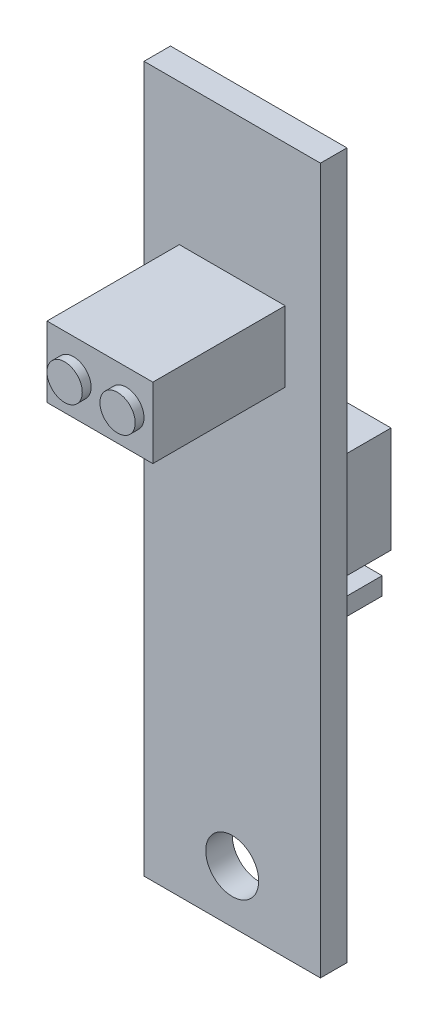
ISO-10303-21;
HEADER;
FILE_DESCRIPTION(('STEP AP214'),'2;1');
FILE_NAME('part.step','',(''),(''),'','','');
FILE_SCHEMA(('AUTOMOTIVE_DESIGN { 1 0 10303 214 1 1 1 1 }'));
ENDSEC;
DATA;
#1=APPLICATION_CONTEXT('core data for automotive mechanical design processes');
#2=APPLICATION_PROTOCOL_DEFINITION('international standard','automotive_design',2000,#1);
#3=PRODUCT_CONTEXT('',#1,'mechanical');
#4=PRODUCT('Part','Part','',(#3));
#5=PRODUCT_RELATED_PRODUCT_CATEGORY('part','',(#4));
#6=PRODUCT_DEFINITION_FORMATION('','',#4);
#7=PRODUCT_DEFINITION_CONTEXT('part definition',#1,'design');
#8=PRODUCT_DEFINITION('design','',#6,#7);
#9=PRODUCT_DEFINITION_SHAPE('','',#8);
#10=(LENGTH_UNIT() NAMED_UNIT(*) SI_UNIT(.MILLI.,.METRE.));
#11=(NAMED_UNIT(*) PLANE_ANGLE_UNIT() SI_UNIT($,.RADIAN.));
#12=(NAMED_UNIT(*) SI_UNIT($,.STERADIAN.) SOLID_ANGLE_UNIT());
#13=UNCERTAINTY_MEASURE_WITH_UNIT(LENGTH_MEASURE(1.E-05),#10,'distance_accuracy_value','');
#14=(GEOMETRIC_REPRESENTATION_CONTEXT(3) GLOBAL_UNCERTAINTY_ASSIGNED_CONTEXT((#13)) GLOBAL_UNIT_ASSIGNED_CONTEXT((#10,
#11,#12)) REPRESENTATION_CONTEXT('',''));
#15=CARTESIAN_POINT('',(0.,0.,0.));
#16=DIRECTION('',(0.,0.,1.));
#17=DIRECTION('',(1.,0.,0.));
#18=AXIS2_PLACEMENT_3D('',#15,#16,#17);
#19=CARTESIAN_POINT('',(0.,0.,-0.5));
#20=DIRECTION('',(0.,0.,1.));
#21=DIRECTION('',(1.,0.,0.));
#22=AXIS2_PLACEMENT_3D('',#19,#20,#21);
#23=PLANE('',#22);
#24=DIRECTION('',(1.,0.,0.));
#25=VECTOR('',#24,1.);
#26=CARTESIAN_POINT('',(0.,15.5,-0.5));
#27=LINE('',#26,#25);
#28=CARTESIAN_POINT('',(2.5,15.5,-0.5));
#29=VERTEX_POINT('',#28);
#30=CARTESIAN_POINT('',(3.5,15.5,-0.5));
#31=VERTEX_POINT('',#30);
#32=EDGE_CURVE('E330',#29,#31,#27,.T.);
#33=ORIENTED_EDGE('',*,*,#32,.F.);
#34=DIRECTION('',(0.,-1.,0.));
#35=VECTOR('',#34,1.);
#36=CARTESIAN_POINT('',(2.5,0.,-0.5));
#37=LINE('',#36,#35);
#38=CARTESIAN_POINT('',(2.5,14.5,-0.5));
#39=VERTEX_POINT('',#38);
#40=EDGE_CURVE('E327',#29,#39,#37,.T.);
#41=ORIENTED_EDGE('',*,*,#40,.T.);
#42=DIRECTION('',(1.,0.,0.));
#43=VECTOR('',#42,1.);
#44=CARTESIAN_POINT('',(0.,14.5,-0.5));
#45=LINE('',#44,#43);
#46=CARTESIAN_POINT('',(3.5,14.5,-0.5));
#47=VERTEX_POINT('',#46);
#48=EDGE_CURVE('E337',#39,#47,#45,.T.);
#49=ORIENTED_EDGE('',*,*,#48,.T.);
#50=DIRECTION('',(0.,-1.,0.));
#51=VECTOR('',#50,1.);
#52=CARTESIAN_POINT('',(3.5,0.,-0.5));
#53=LINE('',#52,#51);
#54=EDGE_CURVE('E55',#31,#47,#53,.T.);
#55=ORIENTED_EDGE('',*,*,#54,.F.);
#56=EDGE_LOOP('',(#33,#41,#49,#55));
#57=FACE_BOUND('',#56,.T.);
#58=DIRECTION('',(1.,0.,0.));
#59=VECTOR('',#58,1.);
#60=CARTESIAN_POINT('',(0.,15.5,-0.5));
#61=LINE('',#60,#59);
#62=CARTESIAN_POINT('',(4.5,15.5,-0.5));
#63=VERTEX_POINT('',#62);
#64=CARTESIAN_POINT('',(5.5,15.5,-0.5));
#65=VERTEX_POINT('',#64);
#66=EDGE_CURVE('E371',#63,#65,#61,.T.);
#67=ORIENTED_EDGE('',*,*,#66,.F.);
#68=DIRECTION('',(0.,-1.,0.));
#69=VECTOR('',#68,1.);
#70=CARTESIAN_POINT('',(4.5,0.,-0.5));
#71=LINE('',#70,#69);
#72=CARTESIAN_POINT('',(4.5,14.5,-0.5));
#73=VERTEX_POINT('',#72);
#74=EDGE_CURVE('E356',#63,#73,#71,.T.);
#75=ORIENTED_EDGE('',*,*,#74,.T.);
#76=DIRECTION('',(1.,0.,0.));
#77=VECTOR('',#76,1.);
#78=CARTESIAN_POINT('',(0.,14.5,-0.5));
#79=LINE('',#78,#77);
#80=CARTESIAN_POINT('',(5.5,14.5,-0.5));
#81=VERTEX_POINT('',#80);
#82=EDGE_CURVE('E361',#73,#81,#79,.T.);
#83=ORIENTED_EDGE('',*,*,#82,.T.);
#84=DIRECTION('',(0.,-1.,0.));
#85=VECTOR('',#84,1.);
#86=CARTESIAN_POINT('',(5.5,0.,-0.5));
#87=LINE('',#86,#85);
#88=EDGE_CURVE('E373',#65,#81,#87,.T.);
#89=ORIENTED_EDGE('',*,*,#88,.F.);
#90=EDGE_LOOP('',(#67,#75,#83,#89));
#91=FACE_BOUND('',#90,.T.);
#92=DIRECTION('',(1.,0.,0.));
#93=VECTOR('',#92,1.);
#94=CARTESIAN_POINT('',(2.,14.,-0.5));
#95=LINE('',#94,#93);
#96=CARTESIAN_POINT('',(2.,14.,-0.5));
#97=VERTEX_POINT('',#96);
#98=CARTESIAN_POINT('',(8.,14.,-0.5));
#99=VERTEX_POINT('',#98);
#100=EDGE_CURVE('E418',#97,#99,#95,.T.);
#101=ORIENTED_EDGE('',*,*,#100,.F.);
#102=DIRECTION('',(0.,1.,0.));
#103=VECTOR('',#102,1.);
#104=CARTESIAN_POINT('',(2.,14.,-0.5));
#105=LINE('',#104,#103);
#106=CARTESIAN_POINT('',(2.,16.,-0.5));
#107=VERTEX_POINT('',#106);
#108=EDGE_CURVE('E426',#97,#107,#105,.T.);
#109=ORIENTED_EDGE('',*,*,#108,.T.);
#110=DIRECTION('',(1.,0.,0.));
#111=VECTOR('',#110,1.);
#112=CARTESIAN_POINT('',(2.,16.,-0.5));
#113=LINE('',#112,#111);
#114=CARTESIAN_POINT('',(8.,16.,-0.5));
#115=VERTEX_POINT('',#114);
#116=EDGE_CURVE('E424',#107,#115,#113,.T.);
#117=ORIENTED_EDGE('',*,*,#116,.T.);
#118=DIRECTION('',(0.,1.,0.));
#119=VECTOR('',#118,1.);
#120=CARTESIAN_POINT('',(8.,14.,-0.5));
#121=LINE('',#120,#119);
#122=EDGE_CURVE('E421',#99,#115,#121,.T.);
#123=ORIENTED_EDGE('',*,*,#122,.F.);
#124=EDGE_LOOP('',(#101,#109,#117,#123));
#125=FACE_BOUND('',#124,.T.);
#126=DIRECTION('',(1.,0.,0.));
#127=VECTOR('',#126,1.);
#128=CARTESIAN_POINT('',(0.,15.5,-0.5));
#129=LINE('',#128,#127);
#130=CARTESIAN_POINT('',(6.5,15.5,-0.5));
#131=VERTEX_POINT('',#130);
#132=CARTESIAN_POINT('',(7.5,15.5,-0.5));
#133=VERTEX_POINT('',#132);
#134=EDGE_CURVE('E386',#131,#133,#129,.T.);
#135=ORIENTED_EDGE('',*,*,#134,.F.);
#136=DIRECTION('',(0.,-1.,0.));
#137=VECTOR('',#136,1.);
#138=CARTESIAN_POINT('',(6.5,0.,-0.5));
#139=LINE('',#138,#137);
#140=CARTESIAN_POINT('',(6.5,14.5,-0.5));
#141=VERTEX_POINT('',#140);
#142=EDGE_CURVE('E391',#131,#141,#139,.T.);
#143=ORIENTED_EDGE('',*,*,#142,.T.);
#144=DIRECTION('',(1.,0.,0.));
#145=VECTOR('',#144,1.);
#146=CARTESIAN_POINT('',(0.,14.5,-0.5));
#147=LINE('',#146,#145);
#148=CARTESIAN_POINT('',(7.5,14.5,-0.5));
#149=VERTEX_POINT('',#148);
#150=EDGE_CURVE('E405',#141,#149,#147,.T.);
#151=ORIENTED_EDGE('',*,*,#150,.T.);
#152=DIRECTION('',(0.,-1.,0.));
#153=VECTOR('',#152,1.);
#154=CARTESIAN_POINT('',(7.5,0.,-0.5));
#155=LINE('',#154,#153);
#156=EDGE_CURVE('E402',#133,#149,#155,.T.);
#157=ORIENTED_EDGE('',*,*,#156,.F.);
#158=EDGE_LOOP('',(#135,#143,#151,#157));
#159=FACE_BOUND('',#158,.T.);
#160=ADVANCED_FACE('F32',(#57,#91,#125,#159),#23,.F.);
#161=CARTESIAN_POINT('',(0.,0.,0.));
#162=DIRECTION('',(0.,0.,-1.));
#163=DIRECTION('',(-1.,0.,0.));
#164=AXIS2_PLACEMENT_3D('',#161,#162,#163);
#165=PLANE('',#164);
#166=DIRECTION('',(-1.,0.,0.));
#167=VECTOR('',#166,1.);
#168=CARTESIAN_POINT('',(0.,14.,0.));
#169=LINE('',#168,#167);
#170=CARTESIAN_POINT('',(8.,14.,0.));
#171=VERTEX_POINT('',#170);
#172=CARTESIAN_POINT('',(2.,14.,0.));
#173=VERTEX_POINT('',#172);
#174=EDGE_CURVE('E447',#171,#173,#169,.T.);
#175=ORIENTED_EDGE('',*,*,#174,.F.);
#176=DIRECTION('',(0.,-1.,0.));
#177=VECTOR('',#176,1.);
#178=CARTESIAN_POINT('',(8.,0.,0.));
#179=LINE('',#178,#177);
#180=CARTESIAN_POINT('',(8.,16.,0.));
#181=VERTEX_POINT('',#180);
#182=EDGE_CURVE('E432',#181,#171,#179,.T.);
#183=ORIENTED_EDGE('',*,*,#182,.F.);
#184=DIRECTION('',(-1.,0.,0.));
#185=VECTOR('',#184,1.);
#186=CARTESIAN_POINT('',(0.,16.,0.));
#187=LINE('',#186,#185);
#188=CARTESIAN_POINT('',(2.,16.,0.));
#189=VERTEX_POINT('',#188);
#190=EDGE_CURVE('E443',#181,#189,#187,.T.);
#191=ORIENTED_EDGE('',*,*,#190,.T.);
#192=DIRECTION('',(0.,-1.,0.));
#193=VECTOR('',#192,1.);
#194=CARTESIAN_POINT('',(2.,0.,0.));
#195=LINE('',#194,#193);
#196=EDGE_CURVE('E445',#189,#173,#195,.T.);
#197=ORIENTED_EDGE('',*,*,#196,.T.);
#198=EDGE_LOOP('',(#175,#183,#191,#197));
#199=FACE_BOUND('',#198,.T.);
#200=CARTESIAN_POINT('',(5.,3.,0.));
#201=DIRECTION('',(0.,0.,1.));
#202=DIRECTION('',(1.,0.,0.));
#203=AXIS2_PLACEMENT_3D('',#200,#201,#202);
#204=CIRCLE('',#203,1.5);
#205=CARTESIAN_POINT('',(6.5,3.,0.));
#206=VERTEX_POINT('',#205);
#207=EDGE_CURVE('E247',#206,#206,#204,.T.);
#208=ORIENTED_EDGE('',*,*,#207,.T.);
#209=EDGE_LOOP('',(#208));
#210=FACE_BOUND('',#209,.T.);
#211=DIRECTION('',(0.,-1.,0.));
#212=VECTOR('',#211,1.);
#213=CARTESIAN_POINT('',(0.,0.,0.));
#214=LINE('',#213,#212);
#215=CARTESIAN_POINT('',(0.,40.,0.));
#216=VERTEX_POINT('',#215);
#217=CARTESIAN_POINT('',(0.,0.,0.));
#218=VERTEX_POINT('',#217);
#219=EDGE_CURVE('E251',#216,#218,#214,.T.);
#220=ORIENTED_EDGE('',*,*,#219,.F.);
#221=DIRECTION('',(-1.,0.,0.));
#222=VECTOR('',#221,1.);
#223=CARTESIAN_POINT('',(0.,40.,0.));
#224=LINE('',#223,#222);
#225=CARTESIAN_POINT('',(10.,40.,0.));
#226=VERTEX_POINT('',#225);
#227=EDGE_CURVE('E258',#226,#216,#224,.T.);
#228=ORIENTED_EDGE('',*,*,#227,.F.);
#229=DIRECTION('',(0.,1.,0.));
#230=VECTOR('',#229,1.);
#231=CARTESIAN_POINT('',(10.,0.,0.));
#232=LINE('',#231,#230);
#233=CARTESIAN_POINT('',(10.,0.,0.));
#234=VERTEX_POINT('',#233);
#235=EDGE_CURVE('E269',#234,#226,#232,.T.);
#236=ORIENTED_EDGE('',*,*,#235,.F.);
#237=DIRECTION('',(1.,0.,0.));
#238=VECTOR('',#237,1.);
#239=CARTESIAN_POINT('',(0.,0.,0.));
#240=LINE('',#239,#238);
#241=EDGE_CURVE('E267',#218,#234,#240,.T.);
#242=ORIENTED_EDGE('',*,*,#241,.F.);
#243=EDGE_LOOP('',(#220,#228,#236,#242));
#244=FACE_BOUND('',#243,.T.);
#245=DIRECTION('',(1.,0.,0.));
#246=VECTOR('',#245,1.);
#247=CARTESIAN_POINT('',(0.,17.,0.));
#248=LINE('',#247,#246);
#249=CARTESIAN_POINT('',(2.,17.,0.));
#250=VERTEX_POINT('',#249);
#251=CARTESIAN_POINT('',(8.,17.,0.));
#252=VERTEX_POINT('',#251);
#253=EDGE_CURVE('E40',#250,#252,#248,.T.);
#254=ORIENTED_EDGE('',*,*,#253,.T.);
#255=DIRECTION('',(0.,1.,0.));
#256=VECTOR('',#255,1.);
#257=CARTESIAN_POINT('',(8.,0.,0.));
#258=LINE('',#257,#256);
#259=CARTESIAN_POINT('',(8.,23.,0.));
#260=VERTEX_POINT('',#259);
#261=EDGE_CURVE('E11',#252,#260,#258,.T.);
#262=ORIENTED_EDGE('',*,*,#261,.T.);
#263=DIRECTION('',(1.,0.,0.));
#264=VECTOR('',#263,1.);
#265=CARTESIAN_POINT('',(0.,23.,0.));
#266=LINE('',#265,#264);
#267=CARTESIAN_POINT('',(2.,23.,0.));
#268=VERTEX_POINT('',#267);
#269=EDGE_CURVE('E283',#268,#260,#266,.T.);
#270=ORIENTED_EDGE('',*,*,#269,.F.);
#271=DIRECTION('',(0.,1.,0.));
#272=VECTOR('',#271,1.);
#273=CARTESIAN_POINT('',(2.,0.,0.));
#274=LINE('',#273,#272);
#275=EDGE_CURVE('E286',#250,#268,#274,.T.);
#276=ORIENTED_EDGE('',*,*,#275,.F.);
#277=EDGE_LOOP('',(#254,#262,#270,#276));
#278=FACE_BOUND('',#277,.T.);
#279=ADVANCED_FACE('F291',(#199,#210,#244,#278),#165,.T.);
#280=CARTESIAN_POINT('',(0.,0.,1.5));
#281=DIRECTION('',(0.,0.,-1.));
#282=DIRECTION('',(-1.,0.,0.));
#283=AXIS2_PLACEMENT_3D('',#280,#281,#282);
#284=PLANE('',#283);
#285=DIRECTION('',(0.,-1.,0.));
#286=VECTOR('',#285,1.);
#287=CARTESIAN_POINT('',(2.,32.,1.5));
#288=LINE('',#287,#286);
#289=CARTESIAN_POINT('',(2.,32.,1.5));
#290=VERTEX_POINT('',#289);
#291=CARTESIAN_POINT('',(2.,28.,1.5));
#292=VERTEX_POINT('',#291);
#293=EDGE_CURVE('E306',#290,#292,#288,.T.);
#294=ORIENTED_EDGE('',*,*,#293,.F.);
#295=DIRECTION('',(1.,0.,0.));
#296=VECTOR('',#295,1.);
#297=CARTESIAN_POINT('',(2.,32.,1.5));
#298=LINE('',#297,#296);
#299=CARTESIAN_POINT('',(8.00000000000001,32.,1.5));
#300=VERTEX_POINT('',#299);
#301=EDGE_CURVE('E235',#290,#300,#298,.T.);
#302=ORIENTED_EDGE('',*,*,#301,.T.);
#303=DIRECTION('',(0.,-1.,0.));
#304=VECTOR('',#303,1.);
#305=CARTESIAN_POINT('',(8.00000000000001,32.,1.5));
#306=LINE('',#305,#304);
#307=CARTESIAN_POINT('',(8.00000000000001,28.,1.5));
#308=VERTEX_POINT('',#307);
#309=EDGE_CURVE('E241',#300,#308,#306,.T.);
#310=ORIENTED_EDGE('',*,*,#309,.T.);
#311=DIRECTION('',(1.,0.,0.));
#312=VECTOR('',#311,1.);
#313=CARTESIAN_POINT('',(2.,28.,1.5));
#314=LINE('',#313,#312);
#315=EDGE_CURVE('E309',#292,#308,#314,.T.);
#316=ORIENTED_EDGE('',*,*,#315,.F.);
#317=EDGE_LOOP('',(#294,#302,#310,#316));
#318=FACE_BOUND('',#317,.T.);
#319=DIRECTION('',(0.,-1.,0.));
#320=VECTOR('',#319,1.);
#321=CARTESIAN_POINT('',(0.,0.,1.5));
#322=LINE('',#321,#320);
#323=CARTESIAN_POINT('',(0.,40.,1.5));
#324=VERTEX_POINT('',#323);
#325=CARTESIAN_POINT('',(0.,0.,1.5));
#326=VERTEX_POINT('',#325);
#327=EDGE_CURVE('E254',#324,#326,#322,.T.);
#328=ORIENTED_EDGE('',*,*,#327,.T.);
#329=DIRECTION('',(1.,0.,0.));
#330=VECTOR('',#329,1.);
#331=CARTESIAN_POINT('',(0.,0.,1.5));
#332=LINE('',#331,#330);
#333=CARTESIAN_POINT('',(10.,0.,1.5));
#334=VERTEX_POINT('',#333);
#335=EDGE_CURVE('E257',#326,#334,#332,.T.);
#336=ORIENTED_EDGE('',*,*,#335,.T.);
#337=DIRECTION('',(0.,1.,0.));
#338=VECTOR('',#337,1.);
#339=CARTESIAN_POINT('',(10.,0.,1.5));
#340=LINE('',#339,#338);
#341=CARTESIAN_POINT('',(10.,40.,1.5));
#342=VERTEX_POINT('',#341);
#343=EDGE_CURVE('E260',#334,#342,#340,.T.);
#344=ORIENTED_EDGE('',*,*,#343,.T.);
#345=DIRECTION('',(-1.,0.,0.));
#346=VECTOR('',#345,1.);
#347=CARTESIAN_POINT('',(0.,40.,1.5));
#348=LINE('',#347,#346);
#349=EDGE_CURVE('E262',#342,#324,#348,.T.);
#350=ORIENTED_EDGE('',*,*,#349,.T.);
#351=EDGE_LOOP('',(#328,#336,#344,#350));
#352=FACE_BOUND('',#351,.T.);
#353=CARTESIAN_POINT('',(5.,3.,1.5));
#354=DIRECTION('',(0.,0.,1.));
#355=DIRECTION('',(1.,0.,0.));
#356=AXIS2_PLACEMENT_3D('',#353,#354,#355);
#357=CIRCLE('',#356,1.5);
#358=CARTESIAN_POINT('',(6.5,3.,1.5));
#359=VERTEX_POINT('',#358);
#360=EDGE_CURVE('E248',#359,#359,#357,.T.);
#361=ORIENTED_EDGE('',*,*,#360,.F.);
#362=EDGE_LOOP('',(#361));
#363=FACE_BOUND('',#362,.T.);
#364=ADVANCED_FACE('F320',(#318,#352,#363),#284,.F.);
#365=CARTESIAN_POINT('',(0.,0.,1.5));
#366=DIRECTION('',(1.,0.,0.));
#367=DIRECTION('',(0.,0.,-1.));
#368=AXIS2_PLACEMENT_3D('',#365,#366,#367);
#369=PLANE('',#368);
#370=ORIENTED_EDGE('',*,*,#219,.T.);
#371=DIRECTION('',(0.,0.,-1.));
#372=VECTOR('',#371,1.);
#373=CARTESIAN_POINT('',(0.,0.,1.5));
#374=LINE('',#373,#372);
#375=EDGE_CURVE('E280',#326,#218,#374,.T.);
#376=ORIENTED_EDGE('',*,*,#375,.F.);
#377=ORIENTED_EDGE('',*,*,#327,.F.);
#378=DIRECTION('',(0.,0.,-1.));
#379=VECTOR('',#378,1.);
#380=CARTESIAN_POINT('',(0.,40.,1.5));
#381=LINE('',#380,#379);
#382=EDGE_CURVE('E264',#324,#216,#381,.T.);
#383=ORIENTED_EDGE('',*,*,#382,.T.);
#384=EDGE_LOOP('',(#370,#376,#377,#383));
#385=FACE_BOUND('',#384,.T.);
#386=ADVANCED_FACE('F34',(#385),#369,.F.);
#387=CARTESIAN_POINT('',(0.,0.,1.5));
#388=DIRECTION('',(0.,1.,0.));
#389=DIRECTION('',(0.,0.,1.));
#390=AXIS2_PLACEMENT_3D('',#387,#388,#389);
#391=PLANE('',#390);
#392=ORIENTED_EDGE('',*,*,#241,.T.);
#393=DIRECTION('',(0.,0.,-1.));
#394=VECTOR('',#393,1.);
#395=CARTESIAN_POINT('',(10.,0.,1.5));
#396=LINE('',#395,#394);
#397=EDGE_CURVE('E277',#334,#234,#396,.T.);
#398=ORIENTED_EDGE('',*,*,#397,.F.);
#399=ORIENTED_EDGE('',*,*,#335,.F.);
#400=ORIENTED_EDGE('',*,*,#375,.T.);
#401=EDGE_LOOP('',(#392,#398,#399,#400));
#402=FACE_BOUND('',#401,.T.);
#403=ADVANCED_FACE('F647',(#402),#391,.F.);
#404=CARTESIAN_POINT('',(10.,0.,1.5));
#405=DIRECTION('',(-1.,0.,0.));
#406=DIRECTION('',(0.,0.,1.));
#407=AXIS2_PLACEMENT_3D('',#404,#405,#406);
#408=PLANE('',#407);
#409=ORIENTED_EDGE('',*,*,#235,.T.);
#410=DIRECTION('',(0.,0.,-1.));
#411=VECTOR('',#410,1.);
#412=CARTESIAN_POINT('',(10.,40.,1.5));
#413=LINE('',#412,#411);
#414=EDGE_CURVE('E274',#342,#226,#413,.T.);
#415=ORIENTED_EDGE('',*,*,#414,.F.);
#416=ORIENTED_EDGE('',*,*,#343,.F.);
#417=ORIENTED_EDGE('',*,*,#397,.T.);
#418=EDGE_LOOP('',(#409,#415,#416,#417));
#419=FACE_BOUND('',#418,.T.);
#420=ADVANCED_FACE('F644',(#419),#408,.F.);
#421=CARTESIAN_POINT('',(0.,40.,1.5));
#422=DIRECTION('',(0.,-1.,0.));
#423=DIRECTION('',(0.,0.,-1.));
#424=AXIS2_PLACEMENT_3D('',#421,#422,#423);
#425=PLANE('',#424);
#426=ORIENTED_EDGE('',*,*,#227,.T.);
#427=ORIENTED_EDGE('',*,*,#382,.F.);
#428=ORIENTED_EDGE('',*,*,#349,.F.);
#429=ORIENTED_EDGE('',*,*,#414,.T.);
#430=EDGE_LOOP('',(#426,#427,#428,#429));
#431=FACE_BOUND('',#430,.T.);
#432=ADVANCED_FACE('F638',(#431),#425,.F.);
#433=CARTESIAN_POINT('',(5.,3.,1.5));
#434=DIRECTION('',(0.,0.,-1.));
#435=DIRECTION('',(-1.,0.,0.));
#436=AXIS2_PLACEMENT_3D('',#433,#434,#435);
#437=CYLINDRICAL_SURFACE('',#436,1.5);
#438=ORIENTED_EDGE('',*,*,#360,.T.);
#439=EDGE_LOOP('',(#438));
#440=FACE_BOUND('',#439,.T.);
#441=ORIENTED_EDGE('',*,*,#207,.F.);
#442=EDGE_LOOP('',(#441));
#443=FACE_BOUND('',#442,.T.);
#444=ADVANCED_FACE('F635',(#440,#443),#437,.F.);
#445=CARTESIAN_POINT('',(2.,32.,9.5));
#446=DIRECTION('',(1.,0.,0.));
#447=DIRECTION('',(0.,0.,-1.));
#448=AXIS2_PLACEMENT_3D('',#445,#446,#447);
#449=PLANE('',#448);
#450=DIRECTION('',(0.,0.,-1.));
#451=VECTOR('',#450,1.);
#452=CARTESIAN_POINT('',(2.,28.,9.5));
#453=LINE('',#452,#451);
#454=CARTESIAN_POINT('',(2.,28.,9.));
#455=VERTEX_POINT('',#454);
#456=EDGE_CURVE('E230',#455,#292,#453,.T.);
#457=ORIENTED_EDGE('',*,*,#456,.F.);
#458=DIRECTION('',(0.,-1.,0.));
#459=VECTOR('',#458,1.);
#460=CARTESIAN_POINT('',(2.,32.,9.));
#461=LINE('',#460,#459);
#462=CARTESIAN_POINT('',(2.,32.,9.));
#463=VERTEX_POINT('',#462);
#464=EDGE_CURVE('E218',#463,#455,#461,.T.);
#465=ORIENTED_EDGE('',*,*,#464,.F.);
#466=DIRECTION('',(0.,0.,-1.));
#467=VECTOR('',#466,1.);
#468=CARTESIAN_POINT('',(2.,32.,9.5));
#469=LINE('',#468,#467);
#470=EDGE_CURVE('E228',#463,#290,#469,.T.);
#471=ORIENTED_EDGE('',*,*,#470,.T.);
#472=ORIENTED_EDGE('',*,*,#293,.T.);
#473=EDGE_LOOP('',(#457,#465,#471,#472));
#474=FACE_BOUND('',#473,.T.);
#475=ADVANCED_FACE('F226',(#474),#449,.F.);
#476=CARTESIAN_POINT('',(2.,28.,9.5));
#477=DIRECTION('',(0.,1.,0.));
#478=DIRECTION('',(0.,0.,1.));
#479=AXIS2_PLACEMENT_3D('',#476,#477,#478);
#480=PLANE('',#479);
#481=DIRECTION('',(0.,0.,-1.));
#482=VECTOR('',#481,1.);
#483=CARTESIAN_POINT('',(8.00000000000001,28.,9.5));
#484=LINE('',#483,#482);
#485=CARTESIAN_POINT('',(8.00000000000001,28.,9.));
#486=VERTEX_POINT('',#485);
#487=EDGE_CURVE('E239',#486,#308,#484,.T.);
#488=ORIENTED_EDGE('',*,*,#487,.F.);
#489=DIRECTION('',(1.,0.,0.));
#490=VECTOR('',#489,1.);
#491=CARTESIAN_POINT('',(8.00000000000001,28.,9.));
#492=LINE('',#491,#490);
#493=EDGE_CURVE('E231',#455,#486,#492,.T.);
#494=ORIENTED_EDGE('',*,*,#493,.F.);
#495=ORIENTED_EDGE('',*,*,#456,.T.);
#496=ORIENTED_EDGE('',*,*,#315,.T.);
#497=EDGE_LOOP('',(#488,#494,#495,#496));
#498=FACE_BOUND('',#497,.T.);
#499=ADVANCED_FACE('F326',(#498),#480,.F.);
#500=CARTESIAN_POINT('',(8.00000000000001,32.,9.5));
#501=DIRECTION('',(1.,0.,0.));
#502=DIRECTION('',(0.,0.,-1.));
#503=AXIS2_PLACEMENT_3D('',#500,#501,#502);
#504=PLANE('',#503);
#505=DIRECTION('',(0.,1.,0.));
#506=VECTOR('',#505,1.);
#507=CARTESIAN_POINT('',(8.00000000000001,32.,9.));
#508=LINE('',#507,#506);
#509=CARTESIAN_POINT('',(8.00000000000001,32.,9.));
#510=VERTEX_POINT('',#509);
#511=EDGE_CURVE('E47',#486,#510,#508,.T.);
#512=ORIENTED_EDGE('',*,*,#511,.F.);
#513=ORIENTED_EDGE('',*,*,#487,.T.);
#514=ORIENTED_EDGE('',*,*,#309,.F.);
#515=DIRECTION('',(0.,0.,-1.));
#516=VECTOR('',#515,1.);
#517=CARTESIAN_POINT('',(8.00000000000001,32.,9.5));
#518=LINE('',#517,#516);
#519=EDGE_CURVE('E237',#510,#300,#518,.T.);
#520=ORIENTED_EDGE('',*,*,#519,.F.);
#521=EDGE_LOOP('',(#512,#513,#514,#520));
#522=FACE_BOUND('',#521,.T.);
#523=ADVANCED_FACE('F323',(#522),#504,.T.);
#524=CARTESIAN_POINT('',(2.,32.,9.5));
#525=DIRECTION('',(0.,1.,0.));
#526=DIRECTION('',(0.,0.,1.));
#527=AXIS2_PLACEMENT_3D('',#524,#525,#526);
#528=PLANE('',#527);
#529=DIRECTION('',(-1.,0.,0.));
#530=VECTOR('',#529,1.);
#531=CARTESIAN_POINT('',(8.00000000000001,32.,9.));
#532=LINE('',#531,#530);
#533=EDGE_CURVE('E215',#510,#463,#532,.T.);
#534=ORIENTED_EDGE('',*,*,#533,.F.);
#535=ORIENTED_EDGE('',*,*,#519,.T.);
#536=ORIENTED_EDGE('',*,*,#301,.F.);
#537=ORIENTED_EDGE('',*,*,#470,.F.);
#538=EDGE_LOOP('',(#534,#535,#536,#537));
#539=FACE_BOUND('',#538,.T.);
#540=ADVANCED_FACE('F233',(#539),#528,.T.);
#541=CARTESIAN_POINT('',(8.,23.,-4.5));
#542=DIRECTION('',(-1.,0.,0.));
#543=DIRECTION('',(0.,0.,1.));
#544=AXIS2_PLACEMENT_3D('',#541,#542,#543);
#545=PLANE('',#544);
#546=ORIENTED_EDGE('',*,*,#261,.F.);
#547=DIRECTION('',(0.,0.,1.));
#548=VECTOR('',#547,1.);
#549=CARTESIAN_POINT('',(8.,17.,-4.5));
#550=LINE('',#549,#548);
#551=CARTESIAN_POINT('',(8.,17.,-4.5));
#552=VERTEX_POINT('',#551);
#553=EDGE_CURVE('E301',#552,#252,#550,.T.);
#554=ORIENTED_EDGE('',*,*,#553,.F.);
#555=DIRECTION('',(0.,-1.,0.));
#556=VECTOR('',#555,1.);
#557=CARTESIAN_POINT('',(8.,23.,-4.5));
#558=LINE('',#557,#556);
#559=CARTESIAN_POINT('',(8.,23.,-4.5));
#560=VERTEX_POINT('',#559);
#561=EDGE_CURVE('E450',#560,#552,#558,.T.);
#562=ORIENTED_EDGE('',*,*,#561,.F.);
#563=DIRECTION('',(0.,0.,1.));
#564=VECTOR('',#563,1.);
#565=CARTESIAN_POINT('',(8.,23.,-4.5));
#566=LINE('',#565,#564);
#567=EDGE_CURVE('E302',#560,#260,#566,.T.);
#568=ORIENTED_EDGE('',*,*,#567,.T.);
#569=EDGE_LOOP('',(#546,#554,#562,#568));
#570=FACE_BOUND('',#569,.T.);
#571=ADVANCED_FACE('F299',(#570),#545,.F.);
#572=CARTESIAN_POINT('',(8.,17.,-4.5));
#573=DIRECTION('',(0.,1.,0.));
#574=DIRECTION('',(0.,0.,1.));
#575=AXIS2_PLACEMENT_3D('',#572,#573,#574);
#576=PLANE('',#575);
#577=ORIENTED_EDGE('',*,*,#253,.F.);
#578=DIRECTION('',(0.,0.,1.));
#579=VECTOR('',#578,1.);
#580=CARTESIAN_POINT('',(2.,17.,-4.5));
#581=LINE('',#580,#579);
#582=CARTESIAN_POINT('',(2.,17.,-4.5));
#583=VERTEX_POINT('',#582);
#584=EDGE_CURVE('E307',#583,#250,#581,.T.);
#585=ORIENTED_EDGE('',*,*,#584,.F.);
#586=DIRECTION('',(-1.,0.,0.));
#587=VECTOR('',#586,1.);
#588=CARTESIAN_POINT('',(8.,17.,-4.5));
#589=LINE('',#588,#587);
#590=EDGE_CURVE('E304',#552,#583,#589,.T.);
#591=ORIENTED_EDGE('',*,*,#590,.F.);
#592=ORIENTED_EDGE('',*,*,#553,.T.);
#593=EDGE_LOOP('',(#577,#585,#591,#592));
#594=FACE_BOUND('',#593,.T.);
#595=ADVANCED_FACE('F303',(#594),#576,.F.);
#596=CARTESIAN_POINT('',(2.,23.,-4.5));
#597=DIRECTION('',(-1.,0.,0.));
#598=DIRECTION('',(0.,0.,1.));
#599=AXIS2_PLACEMENT_3D('',#596,#597,#598);
#600=PLANE('',#599);
#601=ORIENTED_EDGE('',*,*,#584,.T.);
#602=ORIENTED_EDGE('',*,*,#275,.T.);
#603=DIRECTION('',(0.,0.,1.));
#604=VECTOR('',#603,1.);
#605=CARTESIAN_POINT('',(2.,23.,-4.5));
#606=LINE('',#605,#604);
#607=CARTESIAN_POINT('',(2.,23.,-4.5));
#608=VERTEX_POINT('',#607);
#609=EDGE_CURVE('E311',#608,#268,#606,.T.);
#610=ORIENTED_EDGE('',*,*,#609,.F.);
#611=DIRECTION('',(0.,-1.,0.));
#612=VECTOR('',#611,1.);
#613=CARTESIAN_POINT('',(2.,23.,-4.5));
#614=LINE('',#613,#612);
#615=EDGE_CURVE('E453',#608,#583,#614,.T.);
#616=ORIENTED_EDGE('',*,*,#615,.T.);
#617=EDGE_LOOP('',(#601,#602,#610,#616));
#618=FACE_BOUND('',#617,.T.);
#619=ADVANCED_FACE('F465',(#618),#600,.T.);
#620=CARTESIAN_POINT('',(8.,23.,-4.5));
#621=DIRECTION('',(0.,1.,0.));
#622=DIRECTION('',(0.,0.,1.));
#623=AXIS2_PLACEMENT_3D('',#620,#621,#622);
#624=PLANE('',#623);
#625=ORIENTED_EDGE('',*,*,#609,.T.);
#626=ORIENTED_EDGE('',*,*,#269,.T.);
#627=ORIENTED_EDGE('',*,*,#567,.F.);
#628=DIRECTION('',(-1.,0.,0.));
#629=VECTOR('',#628,1.);
#630=CARTESIAN_POINT('',(8.,23.,-4.5));
#631=LINE('',#630,#629);
#632=EDGE_CURVE('E456',#560,#608,#631,.T.);
#633=ORIENTED_EDGE('',*,*,#632,.T.);
#634=EDGE_LOOP('',(#625,#626,#627,#633));
#635=FACE_BOUND('',#634,.T.);
#636=ADVANCED_FACE('F461',(#635),#624,.T.);
#637=CARTESIAN_POINT('',(0.,0.,-4.5));
#638=DIRECTION('',(0.,0.,-1.));
#639=DIRECTION('',(-1.,0.,0.));
#640=AXIS2_PLACEMENT_3D('',#637,#638,#639);
#641=PLANE('',#640);
#642=ORIENTED_EDGE('',*,*,#561,.T.);
#643=ORIENTED_EDGE('',*,*,#590,.T.);
#644=ORIENTED_EDGE('',*,*,#615,.F.);
#645=ORIENTED_EDGE('',*,*,#632,.F.);
#646=EDGE_LOOP('',(#642,#643,#644,#645));
#647=FACE_BOUND('',#646,.T.);
#648=ADVANCED_FACE('F467',(#647),#641,.T.);
#649=CARTESIAN_POINT('',(2.,14.,-0.5));
#650=DIRECTION('',(0.,-1.,0.));
#651=DIRECTION('',(0.,0.,-1.));
#652=AXIS2_PLACEMENT_3D('',#649,#650,#651);
#653=PLANE('',#652);
#654=DIRECTION('',(0.,0.,1.));
#655=VECTOR('',#654,1.);
#656=CARTESIAN_POINT('',(8.,14.,-0.5));
#657=LINE('',#656,#655);
#658=EDGE_CURVE('E428',#99,#171,#657,.T.);
#659=ORIENTED_EDGE('',*,*,#658,.T.);
#660=ORIENTED_EDGE('',*,*,#174,.T.);
#661=DIRECTION('',(0.,0.,1.));
#662=VECTOR('',#661,1.);
#663=CARTESIAN_POINT('',(2.,14.,-0.5));
#664=LINE('',#663,#662);
#665=EDGE_CURVE('E429',#97,#173,#664,.T.);
#666=ORIENTED_EDGE('',*,*,#665,.F.);
#667=ORIENTED_EDGE('',*,*,#100,.T.);
#668=EDGE_LOOP('',(#659,#660,#666,#667));
#669=FACE_BOUND('',#668,.T.);
#670=ADVANCED_FACE('F469',(#669),#653,.T.);
#671=CARTESIAN_POINT('',(2.,14.,-0.5));
#672=DIRECTION('',(1.,0.,0.));
#673=DIRECTION('',(0.,0.,-1.));
#674=AXIS2_PLACEMENT_3D('',#671,#672,#673);
#675=PLANE('',#674);
#676=ORIENTED_EDGE('',*,*,#196,.F.);
#677=DIRECTION('',(0.,0.,1.));
#678=VECTOR('',#677,1.);
#679=CARTESIAN_POINT('',(2.,16.,-0.5));
#680=LINE('',#679,#678);
#681=EDGE_CURVE('E433',#107,#189,#680,.T.);
#682=ORIENTED_EDGE('',*,*,#681,.F.);
#683=ORIENTED_EDGE('',*,*,#108,.F.);
#684=ORIENTED_EDGE('',*,*,#665,.T.);
#685=EDGE_LOOP('',(#676,#682,#683,#684));
#686=FACE_BOUND('',#685,.T.);
#687=ADVANCED_FACE('F475',(#686),#675,.F.);
#688=CARTESIAN_POINT('',(2.,16.,-0.5));
#689=DIRECTION('',(0.,-1.,0.));
#690=DIRECTION('',(0.,0.,-1.));
#691=AXIS2_PLACEMENT_3D('',#688,#689,#690);
#692=PLANE('',#691);
#693=ORIENTED_EDGE('',*,*,#190,.F.);
#694=DIRECTION('',(0.,0.,1.));
#695=VECTOR('',#694,1.);
#696=CARTESIAN_POINT('',(8.,16.,-0.5));
#697=LINE('',#696,#695);
#698=EDGE_CURVE('E436',#115,#181,#697,.T.);
#699=ORIENTED_EDGE('',*,*,#698,.F.);
#700=ORIENTED_EDGE('',*,*,#116,.F.);
#701=ORIENTED_EDGE('',*,*,#681,.T.);
#702=EDGE_LOOP('',(#693,#699,#700,#701));
#703=FACE_BOUND('',#702,.T.);
#704=ADVANCED_FACE('F495',(#703),#692,.F.);
#705=CARTESIAN_POINT('',(8.,14.,-0.5));
#706=DIRECTION('',(1.,0.,0.));
#707=DIRECTION('',(0.,0.,-1.));
#708=AXIS2_PLACEMENT_3D('',#705,#706,#707);
#709=PLANE('',#708);
#710=ORIENTED_EDGE('',*,*,#698,.T.);
#711=ORIENTED_EDGE('',*,*,#182,.T.);
#712=ORIENTED_EDGE('',*,*,#658,.F.);
#713=ORIENTED_EDGE('',*,*,#122,.T.);
#714=EDGE_LOOP('',(#710,#711,#712,#713));
#715=FACE_BOUND('',#714,.T.);
#716=ADVANCED_FACE('F499',(#715),#709,.T.);
#717=CARTESIAN_POINT('',(0.,15.5,-4.5));
#718=DIRECTION('',(0.,-1.,0.));
#719=DIRECTION('',(0.,0.,-1.));
#720=AXIS2_PLACEMENT_3D('',#717,#718,#719);
#721=PLANE('',#720);
#722=ORIENTED_EDGE('',*,*,#134,.T.);
#723=DIRECTION('',(0.,0.,1.));
#724=VECTOR('',#723,1.);
#725=CARTESIAN_POINT('',(7.5,15.5,-4.5));
#726=LINE('',#725,#724);
#727=CARTESIAN_POINT('',(7.5,15.5,-4.5));
#728=VERTEX_POINT('',#727);
#729=EDGE_CURVE('E416',#728,#133,#726,.T.);
#730=ORIENTED_EDGE('',*,*,#729,.F.);
#731=DIRECTION('',(1.,0.,0.));
#732=VECTOR('',#731,1.);
#733=CARTESIAN_POINT('',(0.,15.5,-4.5));
#734=LINE('',#733,#732);
#735=CARTESIAN_POINT('',(6.5,15.5,-4.5));
#736=VERTEX_POINT('',#735);
#737=EDGE_CURVE('E387',#736,#728,#734,.T.);
#738=ORIENTED_EDGE('',*,*,#737,.F.);
#739=DIRECTION('',(0.,0.,1.));
#740=VECTOR('',#739,1.);
#741=CARTESIAN_POINT('',(6.5,15.5,-4.5));
#742=LINE('',#741,#740);
#743=EDGE_CURVE('E399',#736,#131,#742,.T.);
#744=ORIENTED_EDGE('',*,*,#743,.T.);
#745=EDGE_LOOP('',(#722,#730,#738,#744));
#746=FACE_BOUND('',#745,.T.);
#747=ADVANCED_FACE('F491',(#746),#721,.F.);
#748=CARTESIAN_POINT('',(7.5,0.,-4.5));
#749=DIRECTION('',(-1.,0.,0.));
#750=DIRECTION('',(0.,0.,1.));
#751=AXIS2_PLACEMENT_3D('',#748,#749,#750);
#752=PLANE('',#751);
#753=ORIENTED_EDGE('',*,*,#156,.T.);
#754=DIRECTION('',(0.,0.,1.));
#755=VECTOR('',#754,1.);
#756=CARTESIAN_POINT('',(7.5,14.5,-4.5));
#757=LINE('',#756,#755);
#758=CARTESIAN_POINT('',(7.5,14.5,-4.5));
#759=VERTEX_POINT('',#758);
#760=EDGE_CURVE('E414',#759,#149,#757,.T.);
#761=ORIENTED_EDGE('',*,*,#760,.F.);
#762=DIRECTION('',(0.,-1.,0.));
#763=VECTOR('',#762,1.);
#764=CARTESIAN_POINT('',(7.5,0.,-4.5));
#765=LINE('',#764,#763);
#766=EDGE_CURVE('E390',#728,#759,#765,.T.);
#767=ORIENTED_EDGE('',*,*,#766,.F.);
#768=ORIENTED_EDGE('',*,*,#729,.T.);
#769=EDGE_LOOP('',(#753,#761,#767,#768));
#770=FACE_BOUND('',#769,.T.);
#771=ADVANCED_FACE('F506',(#770),#752,.F.);
#772=CARTESIAN_POINT('',(0.,14.5,-4.5));
#773=DIRECTION('',(0.,-1.,0.));
#774=DIRECTION('',(0.,0.,-1.));
#775=AXIS2_PLACEMENT_3D('',#772,#773,#774);
#776=PLANE('',#775);
#777=ORIENTED_EDGE('',*,*,#150,.F.);
#778=DIRECTION('',(0.,0.,1.));
#779=VECTOR('',#778,1.);
#780=CARTESIAN_POINT('',(6.5,14.5,-4.5));
#781=LINE('',#780,#779);
#782=CARTESIAN_POINT('',(6.5,14.5,-4.5));
#783=VERTEX_POINT('',#782);
#784=EDGE_CURVE('E411',#783,#141,#781,.T.);
#785=ORIENTED_EDGE('',*,*,#784,.F.);
#786=DIRECTION('',(1.,0.,0.));
#787=VECTOR('',#786,1.);
#788=CARTESIAN_POINT('',(0.,14.5,-4.5));
#789=LINE('',#788,#787);
#790=EDGE_CURVE('E393',#783,#759,#789,.T.);
#791=ORIENTED_EDGE('',*,*,#790,.T.);
#792=ORIENTED_EDGE('',*,*,#760,.T.);
#793=EDGE_LOOP('',(#777,#785,#791,#792));
#794=FACE_BOUND('',#793,.T.);
#795=ADVANCED_FACE('F529',(#794),#776,.T.);
#796=CARTESIAN_POINT('',(6.5,0.,-4.5));
#797=DIRECTION('',(-1.,0.,0.));
#798=DIRECTION('',(0.,0.,1.));
#799=AXIS2_PLACEMENT_3D('',#796,#797,#798);
#800=PLANE('',#799);
#801=ORIENTED_EDGE('',*,*,#142,.F.);
#802=ORIENTED_EDGE('',*,*,#743,.F.);
#803=DIRECTION('',(0.,-1.,0.));
#804=VECTOR('',#803,1.);
#805=CARTESIAN_POINT('',(6.5,0.,-4.5));
#806=LINE('',#805,#804);
#807=EDGE_CURVE('E396',#736,#783,#806,.T.);
#808=ORIENTED_EDGE('',*,*,#807,.T.);
#809=ORIENTED_EDGE('',*,*,#784,.T.);
#810=EDGE_LOOP('',(#801,#802,#808,#809));
#811=FACE_BOUND('',#810,.T.);
#812=ADVANCED_FACE('F526',(#811),#800,.T.);
#813=CARTESIAN_POINT('',(0.,0.,-4.5));
#814=DIRECTION('',(0.,0.,-1.));
#815=DIRECTION('',(-1.,0.,0.));
#816=AXIS2_PLACEMENT_3D('',#813,#814,#815);
#817=PLANE('',#816);
#818=ORIENTED_EDGE('',*,*,#737,.T.);
#819=ORIENTED_EDGE('',*,*,#766,.T.);
#820=ORIENTED_EDGE('',*,*,#790,.F.);
#821=ORIENTED_EDGE('',*,*,#807,.F.);
#822=EDGE_LOOP('',(#818,#819,#820,#821));
#823=FACE_BOUND('',#822,.T.);
#824=ADVANCED_FACE('F531',(#823),#817,.T.);
#825=CARTESIAN_POINT('',(4.5,0.,-4.5));
#826=DIRECTION('',(-1.,0.,0.));
#827=DIRECTION('',(0.,0.,1.));
#828=AXIS2_PLACEMENT_3D('',#825,#826,#827);
#829=PLANE('',#828);
#830=ORIENTED_EDGE('',*,*,#74,.F.);
#831=DIRECTION('',(0.,0.,1.));
#832=VECTOR('',#831,1.);
#833=CARTESIAN_POINT('',(4.5,15.5,-4.5));
#834=LINE('',#833,#832);
#835=CARTESIAN_POINT('',(4.5,15.5,-4.5));
#836=VERTEX_POINT('',#835);
#837=EDGE_CURVE('E384',#836,#63,#834,.T.);
#838=ORIENTED_EDGE('',*,*,#837,.F.);
#839=DIRECTION('',(0.,-1.,0.));
#840=VECTOR('',#839,1.);
#841=CARTESIAN_POINT('',(4.5,0.,-4.5));
#842=LINE('',#841,#840);
#843=CARTESIAN_POINT('',(4.5,14.5,-4.5));
#844=VERTEX_POINT('',#843);
#845=EDGE_CURVE('E357',#836,#844,#842,.T.);
#846=ORIENTED_EDGE('',*,*,#845,.T.);
#847=DIRECTION('',(0.,0.,1.));
#848=VECTOR('',#847,1.);
#849=CARTESIAN_POINT('',(4.5,14.5,-4.5));
#850=LINE('',#849,#848);
#851=EDGE_CURVE('E368',#844,#73,#850,.T.);
#852=ORIENTED_EDGE('',*,*,#851,.T.);
#853=EDGE_LOOP('',(#830,#838,#846,#852));
#854=FACE_BOUND('',#853,.T.);
#855=ADVANCED_FACE('F544',(#854),#829,.T.);
#856=CARTESIAN_POINT('',(0.,15.5,-4.5));
#857=DIRECTION('',(0.,-1.,0.));
#858=DIRECTION('',(0.,0.,-1.));
#859=AXIS2_PLACEMENT_3D('',#856,#857,#858);
#860=PLANE('',#859);
#861=ORIENTED_EDGE('',*,*,#66,.T.);
#862=DIRECTION('',(0.,0.,1.));
#863=VECTOR('',#862,1.);
#864=CARTESIAN_POINT('',(5.5,15.5,-4.5));
#865=LINE('',#864,#863);
#866=CARTESIAN_POINT('',(5.5,15.5,-4.5));
#867=VERTEX_POINT('',#866);
#868=EDGE_CURVE('E381',#867,#65,#865,.T.);
#869=ORIENTED_EDGE('',*,*,#868,.F.);
#870=DIRECTION('',(1.,0.,0.));
#871=VECTOR('',#870,1.);
#872=CARTESIAN_POINT('',(0.,15.5,-4.5));
#873=LINE('',#872,#871);
#874=EDGE_CURVE('E360',#836,#867,#873,.T.);
#875=ORIENTED_EDGE('',*,*,#874,.F.);
#876=ORIENTED_EDGE('',*,*,#837,.T.);
#877=EDGE_LOOP('',(#861,#869,#875,#876));
#878=FACE_BOUND('',#877,.T.);
#879=ADVANCED_FACE('F547',(#878),#860,.F.);
#880=CARTESIAN_POINT('',(5.5,0.,-4.5));
#881=DIRECTION('',(-1.,0.,0.));
#882=DIRECTION('',(0.,0.,1.));
#883=AXIS2_PLACEMENT_3D('',#880,#881,#882);
#884=PLANE('',#883);
#885=ORIENTED_EDGE('',*,*,#88,.T.);
#886=DIRECTION('',(0.,0.,1.));
#887=VECTOR('',#886,1.);
#888=CARTESIAN_POINT('',(5.5,14.5,-4.5));
#889=LINE('',#888,#887);
#890=CARTESIAN_POINT('',(5.5,14.5,-4.5));
#891=VERTEX_POINT('',#890);
#892=EDGE_CURVE('E378',#891,#81,#889,.T.);
#893=ORIENTED_EDGE('',*,*,#892,.F.);
#894=DIRECTION('',(0.,-1.,0.));
#895=VECTOR('',#894,1.);
#896=CARTESIAN_POINT('',(5.5,0.,-4.5));
#897=LINE('',#896,#895);
#898=EDGE_CURVE('E363',#867,#891,#897,.T.);
#899=ORIENTED_EDGE('',*,*,#898,.F.);
#900=ORIENTED_EDGE('',*,*,#868,.T.);
#901=EDGE_LOOP('',(#885,#893,#899,#900));
#902=FACE_BOUND('',#901,.T.);
#903=ADVANCED_FACE('F551',(#902),#884,.F.);
#904=CARTESIAN_POINT('',(0.,14.5,-4.5));
#905=DIRECTION('',(0.,-1.,0.));
#906=DIRECTION('',(0.,0.,-1.));
#907=AXIS2_PLACEMENT_3D('',#904,#905,#906);
#908=PLANE('',#907);
#909=ORIENTED_EDGE('',*,*,#82,.F.);
#910=ORIENTED_EDGE('',*,*,#851,.F.);
#911=DIRECTION('',(1.,0.,0.));
#912=VECTOR('',#911,1.);
#913=CARTESIAN_POINT('',(0.,14.5,-4.5));
#914=LINE('',#913,#912);
#915=EDGE_CURVE('E365',#844,#891,#914,.T.);
#916=ORIENTED_EDGE('',*,*,#915,.T.);
#917=ORIENTED_EDGE('',*,*,#892,.T.);
#918=EDGE_LOOP('',(#909,#910,#916,#917));
#919=FACE_BOUND('',#918,.T.);
#920=ADVANCED_FACE('F555',(#919),#908,.T.);
#921=CARTESIAN_POINT('',(0.,0.,-4.5));
#922=DIRECTION('',(0.,0.,-1.));
#923=DIRECTION('',(-1.,0.,0.));
#924=AXIS2_PLACEMENT_3D('',#921,#922,#923);
#925=PLANE('',#924);
#926=ORIENTED_EDGE('',*,*,#845,.F.);
#927=ORIENTED_EDGE('',*,*,#874,.T.);
#928=ORIENTED_EDGE('',*,*,#898,.T.);
#929=ORIENTED_EDGE('',*,*,#915,.F.);
#930=EDGE_LOOP('',(#926,#927,#928,#929));
#931=FACE_BOUND('',#930,.T.);
#932=ADVANCED_FACE('F559',(#931),#925,.T.);
#933=CARTESIAN_POINT('',(2.5,0.,-4.5));
#934=DIRECTION('',(-1.,0.,0.));
#935=DIRECTION('',(0.,0.,1.));
#936=AXIS2_PLACEMENT_3D('',#933,#934,#935);
#937=PLANE('',#936);
#938=ORIENTED_EDGE('',*,*,#40,.F.);
#939=DIRECTION('',(0.,0.,1.));
#940=VECTOR('',#939,1.);
#941=CARTESIAN_POINT('',(2.5,15.5,-4.5));
#942=LINE('',#941,#940);
#943=CARTESIAN_POINT('',(2.5,15.5,-4.5));
#944=VERTEX_POINT('',#943);
#945=EDGE_CURVE('E354',#944,#29,#942,.T.);
#946=ORIENTED_EDGE('',*,*,#945,.F.);
#947=DIRECTION('',(0.,-1.,0.));
#948=VECTOR('',#947,1.);
#949=CARTESIAN_POINT('',(2.5,0.,-4.5));
#950=LINE('',#949,#948);
#951=CARTESIAN_POINT('',(2.5,14.5,-4.5));
#952=VERTEX_POINT('',#951);
#953=EDGE_CURVE('E333',#944,#952,#950,.T.);
#954=ORIENTED_EDGE('',*,*,#953,.T.);
#955=DIRECTION('',(0.,0.,1.));
#956=VECTOR('',#955,1.);
#957=CARTESIAN_POINT('',(2.5,14.5,-4.5));
#958=LINE('',#957,#956);
#959=EDGE_CURVE('E343',#952,#39,#958,.T.);
#960=ORIENTED_EDGE('',*,*,#959,.T.);
#961=EDGE_LOOP('',(#938,#946,#954,#960));
#962=FACE_BOUND('',#961,.T.);
#963=ADVANCED_FACE('F563',(#962),#937,.T.);
#964=CARTESIAN_POINT('',(0.,15.5,-4.5));
#965=DIRECTION('',(0.,-1.,0.));
#966=DIRECTION('',(0.,0.,-1.));
#967=AXIS2_PLACEMENT_3D('',#964,#965,#966);
#968=PLANE('',#967);
#969=ORIENTED_EDGE('',*,*,#32,.T.);
#970=DIRECTION('',(0.,0.,1.));
#971=VECTOR('',#970,1.);
#972=CARTESIAN_POINT('',(3.5,15.5,-4.5));
#973=LINE('',#972,#971);
#974=CARTESIAN_POINT('',(3.5,15.5,-4.5));
#975=VERTEX_POINT('',#974);
#976=EDGE_CURVE('E352',#975,#31,#973,.T.);
#977=ORIENTED_EDGE('',*,*,#976,.F.);
#978=DIRECTION('',(1.,0.,0.));
#979=VECTOR('',#978,1.);
#980=CARTESIAN_POINT('',(0.,15.5,-4.5));
#981=LINE('',#980,#979);
#982=EDGE_CURVE('E336',#944,#975,#981,.T.);
#983=ORIENTED_EDGE('',*,*,#982,.F.);
#984=ORIENTED_EDGE('',*,*,#945,.T.);
#985=EDGE_LOOP('',(#969,#977,#983,#984));
#986=FACE_BOUND('',#985,.T.);
#987=ADVANCED_FACE('F567',(#986),#968,.F.);
#988=CARTESIAN_POINT('',(3.5,0.,-4.5));
#989=DIRECTION('',(-1.,0.,0.));
#990=DIRECTION('',(0.,0.,1.));
#991=AXIS2_PLACEMENT_3D('',#988,#989,#990);
#992=PLANE('',#991);
#993=ORIENTED_EDGE('',*,*,#54,.T.);
#994=DIRECTION('',(0.,0.,1.));
#995=VECTOR('',#994,1.);
#996=CARTESIAN_POINT('',(3.5,14.5,-4.5));
#997=LINE('',#996,#995);
#998=CARTESIAN_POINT('',(3.5,14.5,-4.5));
#999=VERTEX_POINT('',#998);
#1000=EDGE_CURVE('E350',#999,#47,#997,.T.);
#1001=ORIENTED_EDGE('',*,*,#1000,.F.);
#1002=DIRECTION('',(0.,-1.,0.));
#1003=VECTOR('',#1002,1.);
#1004=CARTESIAN_POINT('',(3.5,0.,-4.5));
#1005=LINE('',#1004,#1003);
#1006=EDGE_CURVE('E339',#975,#999,#1005,.T.);
#1007=ORIENTED_EDGE('',*,*,#1006,.F.);
#1008=ORIENTED_EDGE('',*,*,#976,.T.);
#1009=EDGE_LOOP('',(#993,#1001,#1007,#1008));
#1010=FACE_BOUND('',#1009,.T.);
#1011=ADVANCED_FACE('F571',(#1010),#992,.F.);
#1012=CARTESIAN_POINT('',(0.,14.5,-4.5));
#1013=DIRECTION('',(0.,-1.,0.));
#1014=DIRECTION('',(0.,0.,-1.));
#1015=AXIS2_PLACEMENT_3D('',#1012,#1013,#1014);
#1016=PLANE('',#1015);
#1017=ORIENTED_EDGE('',*,*,#48,.F.);
#1018=ORIENTED_EDGE('',*,*,#959,.F.);
#1019=DIRECTION('',(1.,0.,0.));
#1020=VECTOR('',#1019,1.);
#1021=CARTESIAN_POINT('',(0.,14.5,-4.5));
#1022=LINE('',#1021,#1020);
#1023=EDGE_CURVE('E341',#952,#999,#1022,.T.);
#1024=ORIENTED_EDGE('',*,*,#1023,.T.);
#1025=ORIENTED_EDGE('',*,*,#1000,.T.);
#1026=EDGE_LOOP('',(#1017,#1018,#1024,#1025));
#1027=FACE_BOUND('',#1026,.T.);
#1028=ADVANCED_FACE('F575',(#1027),#1016,.T.);
#1029=CARTESIAN_POINT('',(0.,0.,-4.5));
#1030=DIRECTION('',(0.,0.,-1.));
#1031=DIRECTION('',(-1.,0.,0.));
#1032=AXIS2_PLACEMENT_3D('',#1029,#1030,#1031);
#1033=PLANE('',#1032);
#1034=ORIENTED_EDGE('',*,*,#953,.F.);
#1035=ORIENTED_EDGE('',*,*,#982,.T.);
#1036=ORIENTED_EDGE('',*,*,#1006,.T.);
#1037=ORIENTED_EDGE('',*,*,#1023,.F.);
#1038=EDGE_LOOP('',(#1034,#1035,#1036,#1037));
#1039=FACE_BOUND('',#1038,.T.);
#1040=ADVANCED_FACE('F578',(#1039),#1033,.T.);
#1041=CARTESIAN_POINT('',(0.,0.,9.));
#1042=DIRECTION('',(0.,0.,-1.));
#1043=DIRECTION('',(-1.,0.,0.));
#1044=AXIS2_PLACEMENT_3D('',#1041,#1042,#1043);
#1045=PLANE('',#1044);
#1046=CARTESIAN_POINT('',(6.50000000000001,30.,9.));
#1047=DIRECTION('',(0.,0.,1.));
#1048=DIRECTION('',(1.,0.,0.));
#1049=AXIS2_PLACEMENT_3D('',#1046,#1047,#1048);
#1050=CIRCLE('',#1049,1.);
#1051=CARTESIAN_POINT('',(7.50000000000001,30.,9.));
#1052=VERTEX_POINT('',#1051);
#1053=EDGE_CURVE('E603',#1052,#1052,#1050,.T.);
#1054=ORIENTED_EDGE('',*,*,#1053,.F.);
#1055=EDGE_LOOP('',(#1054));
#1056=FACE_BOUND('',#1055,.T.);
#1057=CARTESIAN_POINT('',(3.5,30.,9.));
#1058=DIRECTION('',(0.,0.,1.));
#1059=DIRECTION('',(1.,0.,0.));
#1060=AXIS2_PLACEMENT_3D('',#1057,#1058,#1059);
#1061=CIRCLE('',#1060,1.);
#1062=CARTESIAN_POINT('',(4.5,30.,9.));
#1063=VERTEX_POINT('',#1062);
#1064=EDGE_CURVE('E612',#1063,#1063,#1061,.T.);
#1065=ORIENTED_EDGE('',*,*,#1064,.F.);
#1066=EDGE_LOOP('',(#1065));
#1067=FACE_BOUND('',#1066,.T.);
#1068=ORIENTED_EDGE('',*,*,#511,.T.);
#1069=ORIENTED_EDGE('',*,*,#533,.T.);
#1070=ORIENTED_EDGE('',*,*,#464,.T.);
#1071=ORIENTED_EDGE('',*,*,#493,.T.);
#1072=EDGE_LOOP('',(#1068,#1069,#1070,#1071));
#1073=FACE_BOUND('',#1072,.T.);
#1074=ADVANCED_FACE('F217',(#1056,#1067,#1073),#1045,.F.);
#1075=CARTESIAN_POINT('',(3.5,30.,9.));
#1076=DIRECTION('',(0.,0.,1.));
#1077=DIRECTION('',(1.,0.,0.));
#1078=AXIS2_PLACEMENT_3D('',#1075,#1076,#1077);
#1079=CYLINDRICAL_SURFACE('',#1078,1.);
#1080=ORIENTED_EDGE('',*,*,#1064,.T.);
#1081=EDGE_LOOP('',(#1080));
#1082=FACE_BOUND('',#1081,.T.);
#1083=CARTESIAN_POINT('',(3.5,30.,9.5));
#1084=DIRECTION('',(0.,0.,1.));
#1085=DIRECTION('',(1.,0.,0.));
#1086=AXIS2_PLACEMENT_3D('',#1083,#1084,#1085);
#1087=CIRCLE('',#1086,1.);
#1088=CARTESIAN_POINT('',(4.5,30.,9.5));
#1089=VERTEX_POINT('',#1088);
#1090=EDGE_CURVE('E609',#1089,#1089,#1087,.T.);
#1091=ORIENTED_EDGE('',*,*,#1090,.F.);
#1092=EDGE_LOOP('',(#1091));
#1093=FACE_BOUND('',#1092,.T.);
#1094=ADVANCED_FACE('F585',(#1082,#1093),#1079,.T.);
#1095=CARTESIAN_POINT('',(6.50000000000001,30.,9.));
#1096=DIRECTION('',(0.,0.,1.));
#1097=DIRECTION('',(1.,0.,0.));
#1098=AXIS2_PLACEMENT_3D('',#1095,#1096,#1097);
#1099=CYLINDRICAL_SURFACE('',#1098,1.);
#1100=ORIENTED_EDGE('',*,*,#1053,.T.);
#1101=EDGE_LOOP('',(#1100));
#1102=FACE_BOUND('',#1101,.T.);
#1103=CARTESIAN_POINT('',(6.50000000000001,30.,9.5));
#1104=DIRECTION('',(0.,0.,1.));
#1105=DIRECTION('',(1.,0.,0.));
#1106=AXIS2_PLACEMENT_3D('',#1103,#1104,#1105);
#1107=CIRCLE('',#1106,1.);
#1108=CARTESIAN_POINT('',(7.50000000000001,30.,9.5));
#1109=VERTEX_POINT('',#1108);
#1110=EDGE_CURVE('E606',#1109,#1109,#1107,.T.);
#1111=ORIENTED_EDGE('',*,*,#1110,.F.);
#1112=EDGE_LOOP('',(#1111));
#1113=FACE_BOUND('',#1112,.T.);
#1114=ADVANCED_FACE('F589',(#1102,#1113),#1099,.T.);
#1115=CARTESIAN_POINT('',(0.,0.,9.5));
#1116=DIRECTION('',(0.,0.,1.));
#1117=DIRECTION('',(1.,0.,0.));
#1118=AXIS2_PLACEMENT_3D('',#1115,#1116,#1117);
#1119=PLANE('',#1118);
#1120=ORIENTED_EDGE('',*,*,#1090,.T.);
#1121=EDGE_LOOP('',(#1120));
#1122=FACE_BOUND('',#1121,.T.);
#1123=ADVANCED_FACE('F592',(#1122),#1119,.T.);
#1124=ORIENTED_EDGE('',*,*,#1110,.T.);
#1125=EDGE_LOOP('',(#1124));
#1126=FACE_BOUND('',#1125,.T.);
#1127=ADVANCED_FACE('F597',(#1126),#1119,.T.);
#1128=CLOSED_SHELL('',(#160,#279,#364,#386,#403,#420,#432,#444,#475,#499,#523,#540,#571,#595,
#619,#636,#648,#670,#687,#704,#716,#747,#771,#795,#812,#824,#855,#879,#903,#920,#932,#963,#987,
#1011,#1028,#1040,#1074,#1094,#1114,#1123,#1127));
#1129=MANIFOLD_SOLID_BREP('B2',#1128);
#1130=ADVANCED_BREP_SHAPE_REPRESENTATION('',(#18,#1129),#14);
#1131=SHAPE_DEFINITION_REPRESENTATION(#9,#1130);
ENDSEC;
END-ISO-10303-21;
